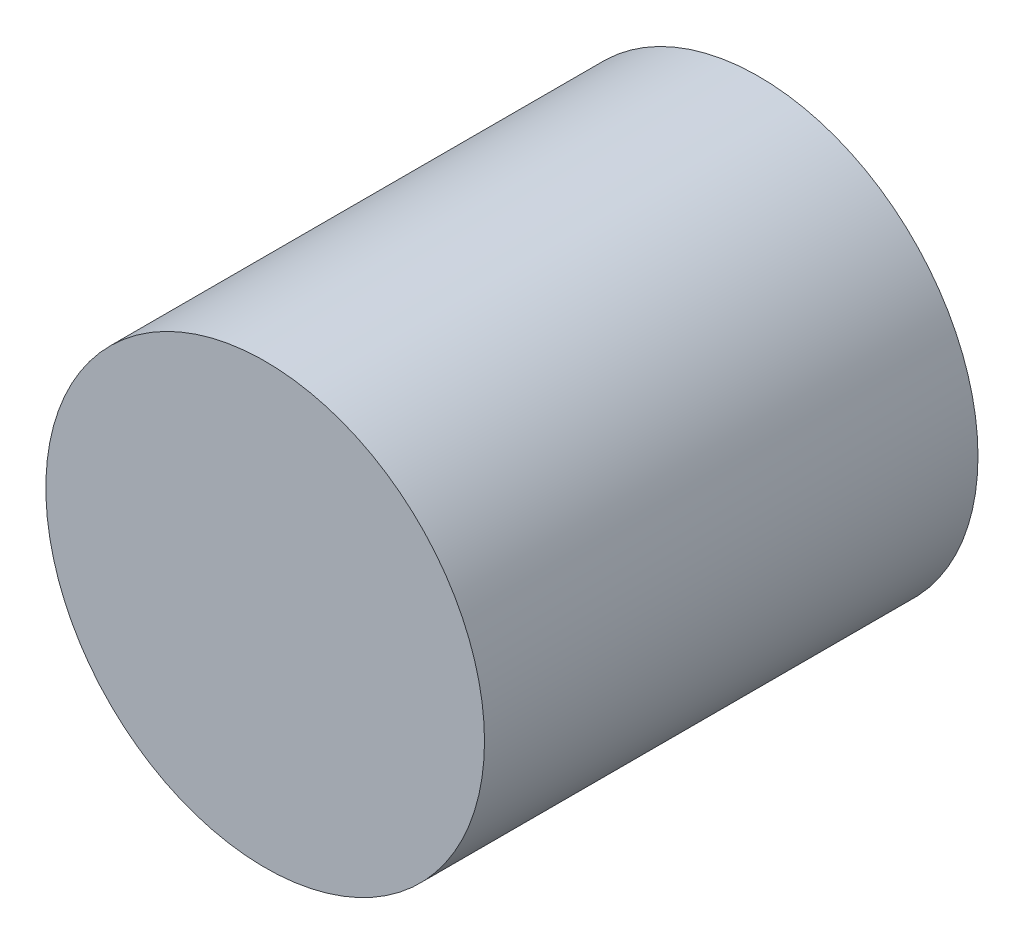
ISO-10303-21;
HEADER;
FILE_DESCRIPTION(('STEP AP214'),'2;1');
FILE_NAME('part.step','',(''),(''),'','','');
FILE_SCHEMA(('AUTOMOTIVE_DESIGN { 1 0 10303 214 1 1 1 1 }'));
ENDSEC;
DATA;
#1=APPLICATION_CONTEXT('core data for automotive mechanical design processes');
#2=APPLICATION_PROTOCOL_DEFINITION('international standard','automotive_design',2000,#1);
#3=PRODUCT_CONTEXT('',#1,'mechanical');
#4=PRODUCT('Part','Part','',(#3));
#5=PRODUCT_RELATED_PRODUCT_CATEGORY('part','',(#4));
#6=PRODUCT_DEFINITION_FORMATION('','',#4);
#7=PRODUCT_DEFINITION_CONTEXT('part definition',#1,'design');
#8=PRODUCT_DEFINITION('design','',#6,#7);
#9=PRODUCT_DEFINITION_SHAPE('','',#8);
#10=(LENGTH_UNIT() NAMED_UNIT(*) SI_UNIT(.MILLI.,.METRE.));
#11=(NAMED_UNIT(*) PLANE_ANGLE_UNIT() SI_UNIT($,.RADIAN.));
#12=(NAMED_UNIT(*) SI_UNIT($,.STERADIAN.) SOLID_ANGLE_UNIT());
#13=UNCERTAINTY_MEASURE_WITH_UNIT(LENGTH_MEASURE(1.E-05),#10,'distance_accuracy_value','');
#14=(GEOMETRIC_REPRESENTATION_CONTEXT(3) GLOBAL_UNCERTAINTY_ASSIGNED_CONTEXT((#13)) GLOBAL_UNIT_ASSIGNED_CONTEXT((#10,
#11,#12)) REPRESENTATION_CONTEXT('',''));
#15=CARTESIAN_POINT('',(0.,0.,0.));
#16=DIRECTION('',(0.,0.,1.));
#17=DIRECTION('',(1.,0.,0.));
#18=AXIS2_PLACEMENT_3D('',#15,#16,#17);
#19=CARTESIAN_POINT('',(-8.89,0.,0.1));
#20=DIRECTION('',(0.,0.,1.));
#21=DIRECTION('',(1.,0.,0.));
#22=AXIS2_PLACEMENT_3D('',#19,#20,#21);
#23=PLANE('',#22);
#24=CARTESIAN_POINT('',(-8.89,0.,0.1));
#25=DIRECTION('',(0.,0.,1.));
#26=DIRECTION('',(1.,0.,0.));
#27=AXIS2_PLACEMENT_3D('',#24,#25,#26);
#28=CIRCLE('',#27,0.8);
#29=CARTESIAN_POINT('',(-8.09,0.,0.1));
#30=VERTEX_POINT('',#29);
#31=EDGE_CURVE('E17',#30,#30,#28,.F.);
#32=ORIENTED_EDGE('',*,*,#31,.F.);
#33=EDGE_LOOP('',(#32));
#34=FACE_BOUND('',#33,.T.);
#35=ADVANCED_FACE('F14',(#34),#23,.T.);
#36=CARTESIAN_POINT('',(-8.89,0.,-1.7));
#37=DIRECTION('',(0.,0.,1.));
#38=DIRECTION('',(1.,0.,0.));
#39=AXIS2_PLACEMENT_3D('',#36,#37,#38);
#40=PLANE('',#39);
#41=CARTESIAN_POINT('',(-8.89,0.,-1.7));
#42=DIRECTION('',(0.,0.,1.));
#43=DIRECTION('',(1.,0.,0.));
#44=AXIS2_PLACEMENT_3D('',#41,#42,#43);
#45=CIRCLE('',#44,0.8);
#46=CARTESIAN_POINT('',(-8.09,0.,-1.7));
#47=VERTEX_POINT('',#46);
#48=EDGE_CURVE('E10',#47,#47,#45,.T.);
#49=ORIENTED_EDGE('',*,*,#48,.F.);
#50=EDGE_LOOP('',(#49));
#51=FACE_BOUND('',#50,.T.);
#52=ADVANCED_FACE('F29',(#51),#40,.F.);
#53=CARTESIAN_POINT('',(-8.89,0.,-1.7));
#54=DIRECTION('',(0.,0.,1.));
#55=DIRECTION('',(1.,0.,0.));
#56=AXIS2_PLACEMENT_3D('',#53,#54,#55);
#57=CYLINDRICAL_SURFACE('',#56,0.8);
#58=ORIENTED_EDGE('',*,*,#48,.T.);
#59=EDGE_LOOP('',(#58));
#60=FACE_BOUND('',#59,.T.);
#61=ORIENTED_EDGE('',*,*,#31,.T.);
#62=EDGE_LOOP('',(#61));
#63=FACE_BOUND('',#62,.T.);
#64=ADVANCED_FACE('F26',(#60,#63),#57,.T.);
#65=CLOSED_SHELL('',(#35,#52,#64));
#66=MANIFOLD_SOLID_BREP('B1',#65);
#67=ADVANCED_BREP_SHAPE_REPRESENTATION('',(#18,#66),#14);
#68=SHAPE_DEFINITION_REPRESENTATION(#9,#67);
ENDSEC;
END-ISO-10303-21;
